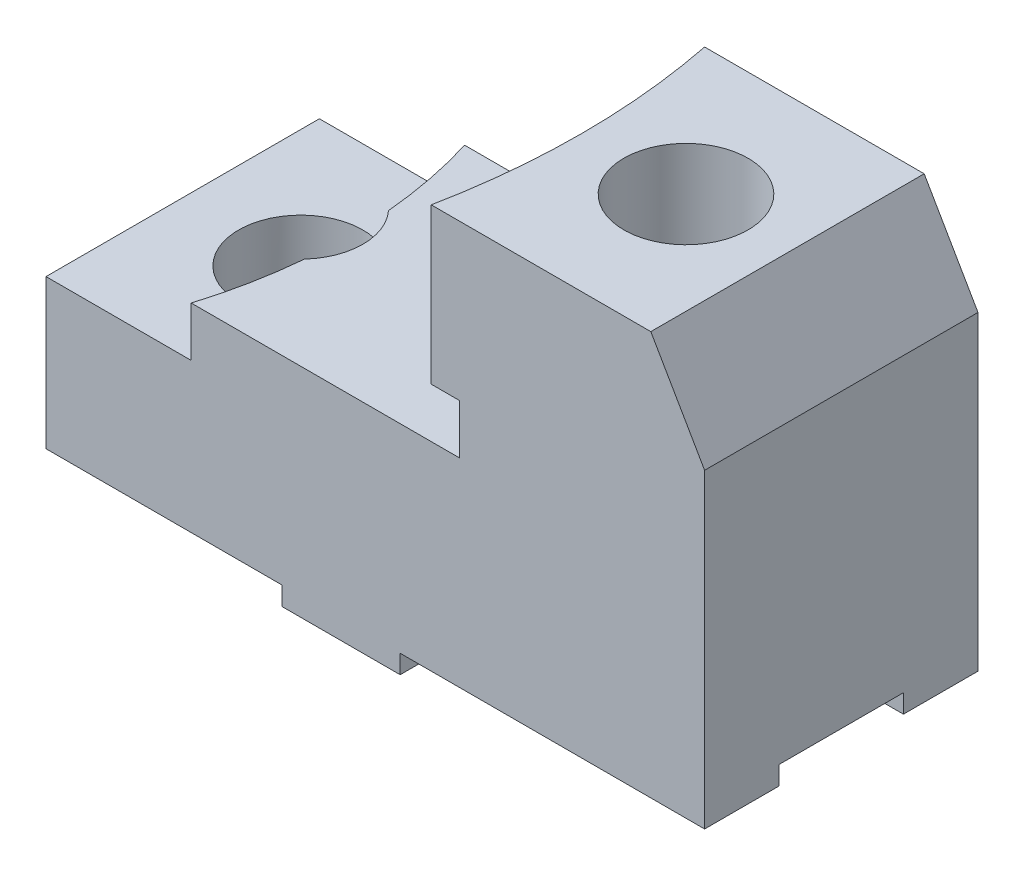
ISO-10303-21;
HEADER;
FILE_DESCRIPTION(('STEP AP214'),'2;1');
FILE_NAME('part.step','',(''),(''),'','','');
FILE_SCHEMA(('AUTOMOTIVE_DESIGN { 1 0 10303 214 1 1 1 1 }'));
ENDSEC;
DATA;
#1=APPLICATION_CONTEXT('core data for automotive mechanical design processes');
#2=APPLICATION_PROTOCOL_DEFINITION('international standard','automotive_design',2000,#1);
#3=PRODUCT_CONTEXT('',#1,'mechanical');
#4=PRODUCT('Part','Part','',(#3));
#5=PRODUCT_RELATED_PRODUCT_CATEGORY('part','',(#4));
#6=PRODUCT_DEFINITION_FORMATION('','',#4);
#7=PRODUCT_DEFINITION_CONTEXT('part definition',#1,'design');
#8=PRODUCT_DEFINITION('design','',#6,#7);
#9=PRODUCT_DEFINITION_SHAPE('','',#8);
#10=(LENGTH_UNIT() NAMED_UNIT(*) SI_UNIT(.MILLI.,.METRE.));
#11=(NAMED_UNIT(*) PLANE_ANGLE_UNIT() SI_UNIT($,.RADIAN.));
#12=(NAMED_UNIT(*) SI_UNIT($,.STERADIAN.) SOLID_ANGLE_UNIT());
#13=UNCERTAINTY_MEASURE_WITH_UNIT(LENGTH_MEASURE(1.E-05),#10,'distance_accuracy_value','');
#14=(GEOMETRIC_REPRESENTATION_CONTEXT(3) GLOBAL_UNCERTAINTY_ASSIGNED_CONTEXT((#13)) GLOBAL_UNIT_ASSIGNED_CONTEXT((#10,
#11,#12)) REPRESENTATION_CONTEXT('',''));
#15=CARTESIAN_POINT('',(0.,0.,0.));
#16=DIRECTION('',(0.,0.,1.));
#17=DIRECTION('',(1.,0.,0.));
#18=AXIS2_PLACEMENT_3D('',#15,#16,#17);
#19=CARTESIAN_POINT('',(-9.49999999999999,-12.,-44.));
#20=DIRECTION('',(0.,-1.,0.));
#21=DIRECTION('',(1.,0.,0.));
#22=AXIS2_PLACEMENT_3D('',#19,#20,#21);
#23=PLANE('',#22);
#24=DIRECTION('',(1.,0.,0.));
#25=VECTOR('',#24,1.);
#26=CARTESIAN_POINT('',(-9.49999999999999,-12.,-32.));
#27=LINE('',#26,#25);
#28=CARTESIAN_POINT('',(-47.5,-12.,-32.));
#29=VERTEX_POINT('',#28);
#30=CARTESIAN_POINT('',(-9.49999999999999,-12.,-32.));
#31=VERTEX_POINT('',#30);
#32=EDGE_CURVE('E268',#29,#31,#27,.T.);
#33=ORIENTED_EDGE('',*,*,#32,.F.);
#34=DIRECTION('',(0.,0.,1.));
#35=VECTOR('',#34,1.);
#36=CARTESIAN_POINT('',(-47.5,-12.,-44.));
#37=LINE('',#36,#35);
#38=CARTESIAN_POINT('',(-47.5,-12.,-44.));
#39=VERTEX_POINT('',#38);
#40=EDGE_CURVE('E403',#39,#29,#37,.T.);
#41=ORIENTED_EDGE('',*,*,#40,.F.);
#42=DIRECTION('',(1.,0.,0.));
#43=VECTOR('',#42,1.);
#44=CARTESIAN_POINT('',(-9.49999999999999,-12.,-44.));
#45=LINE('',#44,#43);
#46=CARTESIAN_POINT('',(-9.49999999999999,-12.,-44.));
#47=VERTEX_POINT('',#46);
#48=EDGE_CURVE('E357',#39,#47,#45,.T.);
#49=ORIENTED_EDGE('',*,*,#48,.T.);
#50=DIRECTION('',(0.,0.,1.));
#51=VECTOR('',#50,1.);
#52=CARTESIAN_POINT('',(-9.49999999999999,-12.,-44.));
#53=LINE('',#52,#51);
#54=EDGE_CURVE('E425',#47,#31,#53,.T.);
#55=ORIENTED_EDGE('',*,*,#54,.T.);
#56=EDGE_LOOP('',(#33,#41,#49,#55));
#57=FACE_BOUND('',#56,.T.);
#58=ADVANCED_FACE('F55',(#57),#23,.T.);
#59=CARTESIAN_POINT('',(58.5,-12.,-44.));
#60=DIRECTION('',(0.,-1.,0.));
#61=DIRECTION('',(0.,0.,-1.));
#62=AXIS2_PLACEMENT_3D('',#59,#60,#61);
#63=PLANE('',#62);
#64=DIRECTION('',(1.,0.,0.));
#65=VECTOR('',#64,1.);
#66=CARTESIAN_POINT('',(58.5,-12.,-32.));
#67=LINE('',#66,#65);
#68=CARTESIAN_POINT('',(9.50000000000001,-12.,-32.));
#69=VERTEX_POINT('',#68);
#70=CARTESIAN_POINT('',(58.5,-12.,-32.));
#71=VERTEX_POINT('',#70);
#72=EDGE_CURVE('E272',#69,#71,#67,.T.);
#73=ORIENTED_EDGE('',*,*,#72,.F.);
#74=DIRECTION('',(0.,0.,1.));
#75=VECTOR('',#74,1.);
#76=CARTESIAN_POINT('',(9.50000000000001,-12.,-44.));
#77=LINE('',#76,#75);
#78=CARTESIAN_POINT('',(9.50000000000001,-12.,-44.));
#79=VERTEX_POINT('',#78);
#80=EDGE_CURVE('E413',#79,#69,#77,.T.);
#81=ORIENTED_EDGE('',*,*,#80,.F.);
#82=DIRECTION('',(1.,0.,0.));
#83=VECTOR('',#82,1.);
#84=CARTESIAN_POINT('',(58.5,-12.,-44.));
#85=LINE('',#84,#83);
#86=CARTESIAN_POINT('',(58.5,-12.,-44.));
#87=VERTEX_POINT('',#86);
#88=EDGE_CURVE('E370',#79,#87,#85,.T.);
#89=ORIENTED_EDGE('',*,*,#88,.T.);
#90=DIRECTION('',(0.,0.,1.));
#91=VECTOR('',#90,1.);
#92=CARTESIAN_POINT('',(58.5,-12.,-44.));
#93=LINE('',#92,#91);
#94=EDGE_CURVE('E410',#87,#71,#93,.T.);
#95=ORIENTED_EDGE('',*,*,#94,.T.);
#96=EDGE_LOOP('',(#73,#81,#89,#95));
#97=FACE_BOUND('',#96,.T.);
#98=ADVANCED_FACE('F468',(#97),#63,.T.);
#99=CARTESIAN_POINT('',(9.50000000000001,-12.,-44.));
#100=DIRECTION('',(1.,0.,0.));
#101=DIRECTION('',(0.,0.,-1.));
#102=AXIS2_PLACEMENT_3D('',#99,#100,#101);
#103=PLANE('',#102);
#104=DIRECTION('',(0.,1.,0.));
#105=VECTOR('',#104,1.);
#106=CARTESIAN_POINT('',(9.50000000000001,-12.,-32.));
#107=LINE('',#106,#105);
#108=CARTESIAN_POINT('',(9.50000000000001,-15.,-32.));
#109=VERTEX_POINT('',#108);
#110=EDGE_CURVE('E270',#109,#69,#107,.T.);
#111=ORIENTED_EDGE('',*,*,#110,.F.);
#112=DIRECTION('',(0.,0.,1.));
#113=VECTOR('',#112,1.);
#114=CARTESIAN_POINT('',(9.50000000000001,-15.,-44.));
#115=LINE('',#114,#113);
#116=CARTESIAN_POINT('',(9.50000000000001,-15.,-44.));
#117=VERTEX_POINT('',#116);
#118=EDGE_CURVE('E417',#117,#109,#115,.T.);
#119=ORIENTED_EDGE('',*,*,#118,.F.);
#120=DIRECTION('',(0.,1.,0.));
#121=VECTOR('',#120,1.);
#122=CARTESIAN_POINT('',(9.50000000000001,-12.,-44.));
#123=LINE('',#122,#121);
#124=EDGE_CURVE('E367',#117,#79,#123,.T.);
#125=ORIENTED_EDGE('',*,*,#124,.T.);
#126=ORIENTED_EDGE('',*,*,#80,.T.);
#127=EDGE_LOOP('',(#111,#119,#125,#126));
#128=FACE_BOUND('',#127,.T.);
#129=ADVANCED_FACE('F466',(#128),#103,.T.);
#130=CARTESIAN_POINT('',(9.50000000000001,-15.,-44.));
#131=DIRECTION('',(0.,-1.,0.));
#132=DIRECTION('',(1.,0.,0.));
#133=AXIS2_PLACEMENT_3D('',#130,#131,#132);
#134=PLANE('',#133);
#135=DIRECTION('',(-1.,0.,0.));
#136=VECTOR('',#135,1.);
#137=CARTESIAN_POINT('',(58.5,-15.,-32.));
#138=LINE('',#137,#136);
#139=CARTESIAN_POINT('',(-9.49999999999999,-15.,-32.));
#140=VERTEX_POINT('',#139);
#141=EDGE_CURVE('E253',#109,#140,#138,.T.);
#142=ORIENTED_EDGE('',*,*,#141,.T.);
#143=DIRECTION('',(0.,0.,1.));
#144=VECTOR('',#143,1.);
#145=CARTESIAN_POINT('',(-9.49999999999999,-15.,-44.));
#146=LINE('',#145,#144);
#147=CARTESIAN_POINT('',(-9.49999999999999,-15.,-44.));
#148=VERTEX_POINT('',#147);
#149=EDGE_CURVE('E421',#148,#140,#146,.T.);
#150=ORIENTED_EDGE('',*,*,#149,.F.);
#151=DIRECTION('',(1.,0.,0.));
#152=VECTOR('',#151,1.);
#153=CARTESIAN_POINT('',(9.50000000000001,-15.,-44.));
#154=LINE('',#153,#152);
#155=EDGE_CURVE('E364',#148,#117,#154,.T.);
#156=ORIENTED_EDGE('',*,*,#155,.T.);
#157=ORIENTED_EDGE('',*,*,#118,.T.);
#158=EDGE_LOOP('',(#142,#150,#156,#157));
#159=FACE_BOUND('',#158,.T.);
#160=ADVANCED_FACE('F462',(#159),#134,.T.);
#161=CARTESIAN_POINT('',(-9.49999999999999,-15.,-44.));
#162=DIRECTION('',(-1.,0.,0.));
#163=DIRECTION('',(0.,0.,1.));
#164=AXIS2_PLACEMENT_3D('',#161,#162,#163);
#165=PLANE('',#164);
#166=DIRECTION('',(0.,-1.,0.));
#167=VECTOR('',#166,1.);
#168=CARTESIAN_POINT('',(-9.49999999999999,-15.,-32.));
#169=LINE('',#168,#167);
#170=EDGE_CURVE('E14',#31,#140,#169,.T.);
#171=ORIENTED_EDGE('',*,*,#170,.F.);
#172=ORIENTED_EDGE('',*,*,#54,.F.);
#173=DIRECTION('',(0.,-1.,0.));
#174=VECTOR('',#173,1.);
#175=CARTESIAN_POINT('',(-9.49999999999999,-15.,-44.));
#176=LINE('',#175,#174);
#177=EDGE_CURVE('E360',#47,#148,#176,.T.);
#178=ORIENTED_EDGE('',*,*,#177,.T.);
#179=ORIENTED_EDGE('',*,*,#149,.T.);
#180=EDGE_LOOP('',(#171,#172,#178,#179));
#181=FACE_BOUND('',#180,.T.);
#182=ADVANCED_FACE('F455',(#181),#165,.T.);
#183=CARTESIAN_POINT('',(-95.8279203103185,53.,-22.));
#184=DIRECTION('',(0.,-1.,0.));
#185=DIRECTION('',(1.,0.,0.));
#186=AXIS2_PLACEMENT_3D('',#183,#184,#185);
#187=CYLINDRICAL_SURFACE('',#186,117.);
#188=DIRECTION('',(0.,-1.,0.));
#189=VECTOR('',#188,1.);
#190=CARTESIAN_POINT('',(19.0850902672484,53.,0.));
#191=LINE('',#190,#189);
#192=CARTESIAN_POINT('',(19.0850902672484,28.,0.));
#193=VERTEX_POINT('',#192);
#194=CARTESIAN_POINT('',(19.0850902672484,20.,0.));
#195=VERTEX_POINT('',#194);
#196=EDGE_CURVE('E324',#193,#195,#191,.T.);
#197=ORIENTED_EDGE('',*,*,#196,.F.);
#198=CARTESIAN_POINT('',(-95.8279203103185,28.,-22.));
#199=DIRECTION('',(0.,1.,0.));
#200=DIRECTION('',(-1.,0.,0.));
#201=AXIS2_PLACEMENT_3D('',#198,#199,#200);
#202=CIRCLE('',#201,117.);
#203=CARTESIAN_POINT('',(19.0850902672484,28.,-44.));
#204=VERTEX_POINT('',#203);
#205=EDGE_CURVE('E300',#193,#204,#202,.T.);
#206=ORIENTED_EDGE('',*,*,#205,.T.);
#207=DIRECTION('',(0.,-1.,0.));
#208=VECTOR('',#207,1.);
#209=CARTESIAN_POINT('',(19.0850902672484,53.,-44.));
#210=LINE('',#209,#208);
#211=CARTESIAN_POINT('',(19.0850902672484,20.,-44.));
#212=VERTEX_POINT('',#211);
#213=EDGE_CURVE('E322',#204,#212,#210,.T.);
#214=ORIENTED_EDGE('',*,*,#213,.T.);
#215=CARTESIAN_POINT('',(-95.8279203103185,20.,-22.));
#216=DIRECTION('',(0.,1.,0.));
#217=DIRECTION('',(-1.,0.,0.));
#218=AXIS2_PLACEMENT_3D('',#215,#216,#217);
#219=CIRCLE('',#218,117.);
#220=EDGE_CURVE('E337',#195,#212,#219,.T.);
#221=ORIENTED_EDGE('',*,*,#220,.F.);
#222=EDGE_LOOP('',(#197,#206,#214,#221));
#223=FACE_BOUND('',#222,.T.);
#224=ADVANCED_FACE('F503',(#223),#187,.F.);
#225=CARTESIAN_POINT('',(-47.5,12.,-44.));
#226=DIRECTION('',(0.,1.,0.));
#227=DIRECTION('',(0.,0.,1.));
#228=AXIS2_PLACEMENT_3D('',#225,#226,#227);
#229=PLANE('',#228);
#230=CARTESIAN_POINT('',(-28.5,12.,-22.));
#231=DIRECTION('',(0.,1.,0.));
#232=DIRECTION('',(0.,0.,1.));
#233=AXIS2_PLACEMENT_3D('',#230,#231,#232);
#234=CIRCLE('',#233,10.);
#235=CARTESIAN_POINT('',(-21.1334339296726,12.,-28.7626699114701));
#236=VERTEX_POINT('',#235);
#237=CARTESIAN_POINT('',(-21.1334339296727,12.,-15.2373300885299));
#238=VERTEX_POINT('',#237);
#239=EDGE_CURVE('E297',#236,#238,#234,.T.);
#240=ORIENTED_EDGE('',*,*,#239,.F.);
#241=CARTESIAN_POINT('',(-95.8279203103185,12.,-22.));
#242=DIRECTION('',(0.,1.,0.));
#243=DIRECTION('',(-1.,0.,0.));
#244=AXIS2_PLACEMENT_3D('',#241,#242,#243);
#245=CIRCLE('',#244,75.);
#246=CARTESIAN_POINT('',(-24.1271532293451,12.,-44.));
#247=VERTEX_POINT('',#246);
#248=EDGE_CURVE('E331',#247,#236,#245,.F.);
#249=ORIENTED_EDGE('',*,*,#248,.F.);
#250=DIRECTION('',(-1.,0.,0.));
#251=VECTOR('',#250,1.);
#252=CARTESIAN_POINT('',(-47.5,12.,-44.));
#253=LINE('',#252,#251);
#254=CARTESIAN_POINT('',(-47.5,12.,-44.));
#255=VERTEX_POINT('',#254);
#256=EDGE_CURVE('E376',#247,#255,#253,.T.);
#257=ORIENTED_EDGE('',*,*,#256,.T.);
#258=DIRECTION('',(0.,0.,1.));
#259=VECTOR('',#258,1.);
#260=CARTESIAN_POINT('',(-47.5,12.,-44.));
#261=LINE('',#260,#259);
#262=CARTESIAN_POINT('',(-47.5,12.,0.));
#263=VERTEX_POINT('',#262);
#264=EDGE_CURVE('E407',#255,#263,#261,.T.);
#265=ORIENTED_EDGE('',*,*,#264,.T.);
#266=DIRECTION('',(-1.,0.,0.));
#267=VECTOR('',#266,1.);
#268=CARTESIAN_POINT('',(-47.5,12.,0.));
#269=LINE('',#268,#267);
#270=CARTESIAN_POINT('',(-24.1271532293451,12.,0.));
#271=VERTEX_POINT('',#270);
#272=EDGE_CURVE('E399',#271,#263,#269,.T.);
#273=ORIENTED_EDGE('',*,*,#272,.F.);
#274=EDGE_CURVE('E326',#238,#271,#245,.F.);
#275=ORIENTED_EDGE('',*,*,#274,.F.);
#276=EDGE_LOOP('',(#240,#249,#257,#265,#273,#275));
#277=FACE_BOUND('',#276,.T.);
#278=ADVANCED_FACE('F497',(#277),#229,.T.);
#279=DIRECTION('',(-1.,0.,0.));
#280=VECTOR('',#279,1.);
#281=CARTESIAN_POINT('',(-9.49999999999999,-12.,-12.));
#282=LINE('',#281,#280);
#283=CARTESIAN_POINT('',(-9.49999999999999,-12.,-12.));
#284=VERTEX_POINT('',#283);
#285=CARTESIAN_POINT('',(-47.5,-12.,-12.));
#286=VERTEX_POINT('',#285);
#287=EDGE_CURVE('E262',#284,#286,#282,.T.);
#288=ORIENTED_EDGE('',*,*,#287,.F.);
#289=CARTESIAN_POINT('',(-9.49999999999999,-12.,0.));
#290=VERTEX_POINT('',#289);
#291=EDGE_CURVE('E381',#284,#290,#53,.T.);
#292=ORIENTED_EDGE('',*,*,#291,.T.);
#293=DIRECTION('',(1.,0.,0.));
#294=VECTOR('',#293,1.);
#295=CARTESIAN_POINT('',(-9.49999999999999,-12.,0.));
#296=LINE('',#295,#294);
#297=CARTESIAN_POINT('',(-47.5,-12.,0.));
#298=VERTEX_POINT('',#297);
#299=EDGE_CURVE('E356',#298,#290,#296,.T.);
#300=ORIENTED_EDGE('',*,*,#299,.F.);
#301=EDGE_CURVE('E406',#286,#298,#37,.T.);
#302=ORIENTED_EDGE('',*,*,#301,.F.);
#303=EDGE_LOOP('',(#288,#292,#300,#302));
#304=FACE_BOUND('',#303,.T.);
#305=ADVANCED_FACE('F57',(#304),#23,.T.);
#306=CARTESIAN_POINT('',(-47.5,-12.,-44.));
#307=DIRECTION('',(-1.,0.,0.));
#308=DIRECTION('',(0.,0.,1.));
#309=AXIS2_PLACEMENT_3D('',#306,#307,#308);
#310=PLANE('',#309);
#311=DIRECTION('',(0.,-1.,0.));
#312=VECTOR('',#311,1.);
#313=CARTESIAN_POINT('',(-47.5,-9.00000000000001,-32.));
#314=LINE('',#313,#312);
#315=CARTESIAN_POINT('',(-47.5,-9.00000000000001,-32.));
#316=VERTEX_POINT('',#315);
#317=EDGE_CURVE('E245',#316,#29,#314,.T.);
#318=ORIENTED_EDGE('',*,*,#317,.F.);
#319=DIRECTION('',(0.,0.,-1.));
#320=VECTOR('',#319,1.);
#321=CARTESIAN_POINT('',(-47.5,-9.00000000000001,-12.));
#322=LINE('',#321,#320);
#323=CARTESIAN_POINT('',(-47.5,-9.00000000000001,-12.));
#324=VERTEX_POINT('',#323);
#325=EDGE_CURVE('E247',#324,#316,#322,.T.);
#326=ORIENTED_EDGE('',*,*,#325,.F.);
#327=DIRECTION('',(0.,1.,0.));
#328=VECTOR('',#327,1.);
#329=CARTESIAN_POINT('',(-47.5,-15.,-12.));
#330=LINE('',#329,#328);
#331=EDGE_CURVE('E226',#286,#324,#330,.T.);
#332=ORIENTED_EDGE('',*,*,#331,.F.);
#333=ORIENTED_EDGE('',*,*,#301,.T.);
#334=DIRECTION('',(0.,-1.,0.));
#335=VECTOR('',#334,1.);
#336=CARTESIAN_POINT('',(-47.5,-12.,0.));
#337=LINE('',#336,#335);
#338=EDGE_CURVE('E361',#263,#298,#337,.T.);
#339=ORIENTED_EDGE('',*,*,#338,.F.);
#340=ORIENTED_EDGE('',*,*,#264,.F.);
#341=DIRECTION('',(0.,-1.,0.));
#342=VECTOR('',#341,1.);
#343=CARTESIAN_POINT('',(-47.5,-12.,-44.));
#344=LINE('',#343,#342);
#345=EDGE_CURVE('E378',#255,#39,#344,.T.);
#346=ORIENTED_EDGE('',*,*,#345,.T.);
#347=ORIENTED_EDGE('',*,*,#40,.T.);
#348=EDGE_LOOP('',(#318,#326,#332,#333,#339,#340,#346,#347));
#349=FACE_BOUND('',#348,.T.);
#350=ADVANCED_FACE('F445',(#349),#310,.T.);
#351=CARTESIAN_POINT('',(58.5,12.,-44.));
#352=DIRECTION('',(1.,0.,0.));
#353=DIRECTION('',(0.,0.,-1.));
#354=AXIS2_PLACEMENT_3D('',#351,#352,#353);
#355=PLANE('',#354);
#356=DIRECTION('',(0.,-1.,0.));
#357=VECTOR('',#356,1.);
#358=CARTESIAN_POINT('',(58.5,-9.00000000000001,-32.));
#359=LINE('',#358,#357);
#360=CARTESIAN_POINT('',(58.5,-9.00000000000001,-32.));
#361=VERTEX_POINT('',#360);
#362=EDGE_CURVE('E239',#361,#71,#359,.T.);
#363=ORIENTED_EDGE('',*,*,#362,.T.);
#364=ORIENTED_EDGE('',*,*,#94,.F.);
#365=DIRECTION('',(0.,1.,0.));
#366=VECTOR('',#365,1.);
#367=CARTESIAN_POINT('',(58.5,12.,-44.));
#368=LINE('',#367,#366);
#369=CARTESIAN_POINT('',(58.5,38.,-44.));
#370=VERTEX_POINT('',#369);
#371=EDGE_CURVE('E373',#87,#370,#368,.T.);
#372=ORIENTED_EDGE('',*,*,#371,.T.);
#373=DIRECTION('',(0.,0.,1.));
#374=VECTOR('',#373,1.);
#375=CARTESIAN_POINT('',(58.5,38.,-44.));
#376=LINE('',#375,#374);
#377=CARTESIAN_POINT('',(58.5,38.,0.));
#378=VERTEX_POINT('',#377);
#379=EDGE_CURVE('E278',#370,#378,#376,.T.);
#380=ORIENTED_EDGE('',*,*,#379,.T.);
#381=DIRECTION('',(0.,1.,0.));
#382=VECTOR('',#381,1.);
#383=CARTESIAN_POINT('',(58.5,12.,0.));
#384=LINE('',#383,#382);
#385=CARTESIAN_POINT('',(58.5,-12.,0.));
#386=VERTEX_POINT('',#385);
#387=EDGE_CURVE('E396',#386,#378,#384,.T.);
#388=ORIENTED_EDGE('',*,*,#387,.F.);
#389=CARTESIAN_POINT('',(58.5,-12.,-12.));
#390=VERTEX_POINT('',#389);
#391=EDGE_CURVE('E244',#390,#386,#93,.T.);
#392=ORIENTED_EDGE('',*,*,#391,.F.);
#393=DIRECTION('',(0.,1.,0.));
#394=VECTOR('',#393,1.);
#395=CARTESIAN_POINT('',(58.5,-15.,-12.));
#396=LINE('',#395,#394);
#397=CARTESIAN_POINT('',(58.5,-9.00000000000001,-12.));
#398=VERTEX_POINT('',#397);
#399=EDGE_CURVE('E223',#390,#398,#396,.T.);
#400=ORIENTED_EDGE('',*,*,#399,.T.);
#401=DIRECTION('',(0.,0.,-1.));
#402=VECTOR('',#401,1.);
#403=CARTESIAN_POINT('',(58.5,-9.00000000000001,-12.));
#404=LINE('',#403,#402);
#405=EDGE_CURVE('E233',#398,#361,#404,.T.);
#406=ORIENTED_EDGE('',*,*,#405,.T.);
#407=EDGE_LOOP('',(#363,#364,#372,#380,#388,#392,#400,#406));
#408=FACE_BOUND('',#407,.T.);
#409=ADVANCED_FACE('F242',(#408),#355,.T.);
#410=DIRECTION('',(-1.,0.,0.));
#411=VECTOR('',#410,1.);
#412=CARTESIAN_POINT('',(58.5,-12.,-12.));
#413=LINE('',#412,#411);
#414=CARTESIAN_POINT('',(9.50000000000001,-12.,-12.));
#415=VERTEX_POINT('',#414);
#416=EDGE_CURVE('E266',#390,#415,#413,.T.);
#417=ORIENTED_EDGE('',*,*,#416,.F.);
#418=ORIENTED_EDGE('',*,*,#391,.T.);
#419=DIRECTION('',(1.,0.,0.));
#420=VECTOR('',#419,1.);
#421=CARTESIAN_POINT('',(58.5,-12.,0.));
#422=LINE('',#421,#420);
#423=CARTESIAN_POINT('',(9.50000000000001,-12.,0.));
#424=VERTEX_POINT('',#423);
#425=EDGE_CURVE('E393',#424,#386,#422,.T.);
#426=ORIENTED_EDGE('',*,*,#425,.F.);
#427=EDGE_CURVE('E416',#415,#424,#77,.T.);
#428=ORIENTED_EDGE('',*,*,#427,.F.);
#429=EDGE_LOOP('',(#417,#418,#426,#428));
#430=FACE_BOUND('',#429,.T.);
#431=ADVANCED_FACE('F476',(#430),#63,.T.);
#432=DIRECTION('',(0.,-1.,0.));
#433=VECTOR('',#432,1.);
#434=CARTESIAN_POINT('',(9.50000000000001,-12.,-12.));
#435=LINE('',#434,#433);
#436=CARTESIAN_POINT('',(9.50000000000001,-15.,-12.));
#437=VERTEX_POINT('',#436);
#438=EDGE_CURVE('E264',#415,#437,#435,.T.);
#439=ORIENTED_EDGE('',*,*,#438,.F.);
#440=ORIENTED_EDGE('',*,*,#427,.T.);
#441=DIRECTION('',(0.,1.,0.));
#442=VECTOR('',#441,1.);
#443=CARTESIAN_POINT('',(9.50000000000001,-12.,0.));
#444=LINE('',#443,#442);
#445=CARTESIAN_POINT('',(9.50000000000001,-15.,0.));
#446=VERTEX_POINT('',#445);
#447=EDGE_CURVE('E390',#446,#424,#444,.T.);
#448=ORIENTED_EDGE('',*,*,#447,.F.);
#449=EDGE_CURVE('E420',#437,#446,#115,.T.);
#450=ORIENTED_EDGE('',*,*,#449,.F.);
#451=EDGE_LOOP('',(#439,#440,#448,#450));
#452=FACE_BOUND('',#451,.T.);
#453=ADVANCED_FACE('F480',(#452),#103,.T.);
#454=DIRECTION('',(-1.,0.,0.));
#455=VECTOR('',#454,1.);
#456=CARTESIAN_POINT('',(58.5,-15.,-12.));
#457=LINE('',#456,#455);
#458=CARTESIAN_POINT('',(-9.49999999999999,-15.,-12.));
#459=VERTEX_POINT('',#458);
#460=EDGE_CURVE('E70',#437,#459,#457,.T.);
#461=ORIENTED_EDGE('',*,*,#460,.F.);
#462=ORIENTED_EDGE('',*,*,#449,.T.);
#463=DIRECTION('',(1.,0.,0.));
#464=VECTOR('',#463,1.);
#465=CARTESIAN_POINT('',(9.50000000000001,-15.,0.));
#466=LINE('',#465,#464);
#467=CARTESIAN_POINT('',(-9.49999999999999,-15.,0.));
#468=VERTEX_POINT('',#467);
#469=EDGE_CURVE('E387',#468,#446,#466,.T.);
#470=ORIENTED_EDGE('',*,*,#469,.F.);
#471=EDGE_CURVE('E424',#459,#468,#146,.T.);
#472=ORIENTED_EDGE('',*,*,#471,.F.);
#473=EDGE_LOOP('',(#461,#462,#470,#472));
#474=FACE_BOUND('',#473,.T.);
#475=ADVANCED_FACE('F482',(#474),#134,.T.);
#476=DIRECTION('',(0.,1.,0.));
#477=VECTOR('',#476,1.);
#478=CARTESIAN_POINT('',(-9.49999999999999,-15.,-12.));
#479=LINE('',#478,#477);
#480=EDGE_CURVE('E63',#459,#284,#479,.T.);
#481=ORIENTED_EDGE('',*,*,#480,.F.);
#482=ORIENTED_EDGE('',*,*,#471,.T.);
#483=DIRECTION('',(0.,-1.,0.));
#484=VECTOR('',#483,1.);
#485=CARTESIAN_POINT('',(-9.49999999999999,-15.,0.));
#486=LINE('',#485,#484);
#487=EDGE_CURVE('E384',#290,#468,#486,.T.);
#488=ORIENTED_EDGE('',*,*,#487,.F.);
#489=ORIENTED_EDGE('',*,*,#291,.F.);
#490=EDGE_LOOP('',(#481,#482,#488,#489));
#491=FACE_BOUND('',#490,.T.);
#492=ADVANCED_FACE('F437',(#491),#165,.T.);
#493=CARTESIAN_POINT('',(0.,0.,-44.));
#494=DIRECTION('',(0.,0.,-1.));
#495=DIRECTION('',(-1.,0.,0.));
#496=AXIS2_PLACEMENT_3D('',#493,#494,#495);
#497=PLANE('',#496);
#498=DIRECTION('',(0.499999999999995,-0.866025403784442,0.));
#499=VECTOR('',#498,1.);
#500=CARTESIAN_POINT('',(49.8397459621557,53.,-44.));
#501=LINE('',#500,#499);
#502=CARTESIAN_POINT('',(49.8397459621557,53.,-44.));
#503=VERTEX_POINT('',#502);
#504=EDGE_CURVE('E78',#503,#370,#501,.T.);
#505=ORIENTED_EDGE('',*,*,#504,.T.);
#506=ORIENTED_EDGE('',*,*,#371,.F.);
#507=ORIENTED_EDGE('',*,*,#88,.F.);
#508=ORIENTED_EDGE('',*,*,#124,.F.);
#509=ORIENTED_EDGE('',*,*,#155,.F.);
#510=ORIENTED_EDGE('',*,*,#177,.F.);
#511=ORIENTED_EDGE('',*,*,#48,.F.);
#512=ORIENTED_EDGE('',*,*,#345,.F.);
#513=ORIENTED_EDGE('',*,*,#256,.F.);
#514=DIRECTION('',(0.,-1.,0.));
#515=VECTOR('',#514,1.);
#516=CARTESIAN_POINT('',(-24.1271532293451,20.,-44.));
#517=LINE('',#516,#515);
#518=CARTESIAN_POINT('',(-24.1271532293451,20.,-44.));
#519=VERTEX_POINT('',#518);
#520=EDGE_CURVE('E347',#519,#247,#517,.T.);
#521=ORIENTED_EDGE('',*,*,#520,.F.);
#522=DIRECTION('',(-1.,0.,0.));
#523=VECTOR('',#522,1.);
#524=CARTESIAN_POINT('',(0.,20.,-44.));
#525=LINE('',#524,#523);
#526=EDGE_CURVE('E340',#212,#519,#525,.T.);
#527=ORIENTED_EDGE('',*,*,#526,.F.);
#528=ORIENTED_EDGE('',*,*,#213,.F.);
#529=DIRECTION('',(1.,0.,0.));
#530=VECTOR('',#529,1.);
#531=CARTESIAN_POINT('',(0.,28.,-44.));
#532=LINE('',#531,#530);
#533=CARTESIAN_POINT('',(14.5,28.,-44.));
#534=VERTEX_POINT('',#533);
#535=EDGE_CURVE('E302',#534,#204,#532,.T.);
#536=ORIENTED_EDGE('',*,*,#535,.F.);
#537=DIRECTION('',(0.,1.,0.));
#538=VECTOR('',#537,1.);
#539=CARTESIAN_POINT('',(14.5,28.,-44.));
#540=LINE('',#539,#538);
#541=CARTESIAN_POINT('',(14.5,53.,-44.));
#542=VERTEX_POINT('',#541);
#543=EDGE_CURVE('E309',#534,#542,#540,.T.);
#544=ORIENTED_EDGE('',*,*,#543,.T.);
#545=DIRECTION('',(-1.,0.,0.));
#546=VECTOR('',#545,1.);
#547=CARTESIAN_POINT('',(0.,53.,-44.));
#548=LINE('',#547,#546);
#549=EDGE_CURVE('E320',#503,#542,#548,.T.);
#550=ORIENTED_EDGE('',*,*,#549,.F.);
#551=EDGE_LOOP('',(#505,#506,#507,#508,#509,#510,#511,#512,#513,#521,#527,#528,#536,#544,#550));
#552=FACE_BOUND('',#551,.T.);
#553=ADVANCED_FACE('F458',(#552),#497,.T.);
#554=CARTESIAN_POINT('',(0.,0.,0.));
#555=DIRECTION('',(0.,0.,-1.));
#556=DIRECTION('',(-1.,0.,0.));
#557=AXIS2_PLACEMENT_3D('',#554,#555,#556);
#558=PLANE('',#557);
#559=ORIENTED_EDGE('',*,*,#387,.T.);
#560=DIRECTION('',(0.499999999999995,-0.866025403784442,0.));
#561=VECTOR('',#560,1.);
#562=CARTESIAN_POINT('',(49.8397459621557,53.,0.));
#563=LINE('',#562,#561);
#564=CARTESIAN_POINT('',(49.8397459621557,53.,0.));
#565=VERTEX_POINT('',#564);
#566=EDGE_CURVE('E274',#565,#378,#563,.T.);
#567=ORIENTED_EDGE('',*,*,#566,.F.);
#568=DIRECTION('',(1.,0.,0.));
#569=VECTOR('',#568,1.);
#570=CARTESIAN_POINT('',(0.,53.,0.));
#571=LINE('',#570,#569);
#572=CARTESIAN_POINT('',(14.5,53.,0.));
#573=VERTEX_POINT('',#572);
#574=EDGE_CURVE('E315',#573,#565,#571,.T.);
#575=ORIENTED_EDGE('',*,*,#574,.F.);
#576=DIRECTION('',(0.,1.,0.));
#577=VECTOR('',#576,1.);
#578=CARTESIAN_POINT('',(14.5,28.,0.));
#579=LINE('',#578,#577);
#580=CARTESIAN_POINT('',(14.5,28.,0.));
#581=VERTEX_POINT('',#580);
#582=EDGE_CURVE('E312',#581,#573,#579,.T.);
#583=ORIENTED_EDGE('',*,*,#582,.F.);
#584=DIRECTION('',(-1.,0.,0.));
#585=VECTOR('',#584,1.);
#586=CARTESIAN_POINT('',(0.,28.,0.));
#587=LINE('',#586,#585);
#588=EDGE_CURVE('E307',#193,#581,#587,.T.);
#589=ORIENTED_EDGE('',*,*,#588,.F.);
#590=ORIENTED_EDGE('',*,*,#196,.T.);
#591=DIRECTION('',(1.,0.,0.));
#592=VECTOR('',#591,1.);
#593=CARTESIAN_POINT('',(0.,20.,0.));
#594=LINE('',#593,#592);
#595=CARTESIAN_POINT('',(-24.1271532293451,20.,0.));
#596=VERTEX_POINT('',#595);
#597=EDGE_CURVE('E333',#596,#195,#594,.T.);
#598=ORIENTED_EDGE('',*,*,#597,.F.);
#599=DIRECTION('',(0.,-1.,0.));
#600=VECTOR('',#599,1.);
#601=CARTESIAN_POINT('',(-24.1271532293451,20.,0.));
#602=LINE('',#601,#600);
#603=EDGE_CURVE('E350',#596,#271,#602,.T.);
#604=ORIENTED_EDGE('',*,*,#603,.T.);
#605=ORIENTED_EDGE('',*,*,#272,.T.);
#606=ORIENTED_EDGE('',*,*,#338,.T.);
#607=ORIENTED_EDGE('',*,*,#299,.T.);
#608=ORIENTED_EDGE('',*,*,#487,.T.);
#609=ORIENTED_EDGE('',*,*,#469,.T.);
#610=ORIENTED_EDGE('',*,*,#447,.T.);
#611=ORIENTED_EDGE('',*,*,#425,.T.);
#612=EDGE_LOOP('',(#559,#567,#575,#583,#589,#590,#598,#604,#605,#606,#607,#608,#609,#610,#611));
#613=FACE_BOUND('',#612,.T.);
#614=ADVANCED_FACE('F440',(#613),#558,.F.);
#615=CARTESIAN_POINT('',(-28.5,20.,-22.));
#616=DIRECTION('',(0.,-1.,0.));
#617=DIRECTION('',(1.,0.,0.));
#618=AXIS2_PLACEMENT_3D('',#615,#616,#617);
#619=CYLINDRICAL_SURFACE('',#618,10.);
#620=DIRECTION('',(0.,-1.,0.));
#621=VECTOR('',#620,1.);
#622=CARTESIAN_POINT('',(-21.1334339296726,20.,-28.7626699114701));
#623=LINE('',#622,#621);
#624=CARTESIAN_POINT('',(-21.1334339296726,20.,-28.7626699114701));
#625=VERTEX_POINT('',#624);
#626=EDGE_CURVE('E344',#625,#236,#623,.T.);
#627=ORIENTED_EDGE('',*,*,#626,.T.);
#628=ORIENTED_EDGE('',*,*,#239,.T.);
#629=DIRECTION('',(0.,-1.,0.));
#630=VECTOR('',#629,1.);
#631=CARTESIAN_POINT('',(-21.1334339296726,20.,-15.2373300885299));
#632=LINE('',#631,#630);
#633=CARTESIAN_POINT('',(-21.1334339296726,20.,-15.2373300885299));
#634=VERTEX_POINT('',#633);
#635=EDGE_CURVE('E353',#634,#238,#632,.T.);
#636=ORIENTED_EDGE('',*,*,#635,.F.);
#637=CARTESIAN_POINT('',(-28.5,20.,-22.));
#638=DIRECTION('',(0.,1.,0.));
#639=DIRECTION('',(-1.,0.,0.));
#640=AXIS2_PLACEMENT_3D('',#637,#638,#639);
#641=CIRCLE('',#640,10.);
#642=EDGE_CURVE('E327',#634,#625,#641,.T.);
#643=ORIENTED_EDGE('',*,*,#642,.T.);
#644=EDGE_LOOP('',(#627,#628,#636,#643));
#645=FACE_BOUND('',#644,.T.);
#646=CARTESIAN_POINT('',(-28.5,-2.,-22.));
#647=DIRECTION('',(0.,1.,0.));
#648=DIRECTION('',(-1.,0.,0.));
#649=AXIS2_PLACEMENT_3D('',#646,#647,#648);
#650=CIRCLE('',#649,10.);
#651=CARTESIAN_POINT('',(-38.5,-2.,-22.));
#652=VERTEX_POINT('',#651);
#653=EDGE_CURVE('E294',#652,#652,#650,.T.);
#654=ORIENTED_EDGE('',*,*,#653,.F.);
#655=EDGE_LOOP('',(#654));
#656=FACE_BOUND('',#655,.T.);
#657=ADVANCED_FACE('F626',(#645,#656),#619,.F.);
#658=CARTESIAN_POINT('',(-95.8279203103185,20.,-22.));
#659=DIRECTION('',(0.,-1.,0.));
#660=DIRECTION('',(1.,0.,0.));
#661=AXIS2_PLACEMENT_3D('',#658,#659,#660);
#662=CYLINDRICAL_SURFACE('',#661,75.);
#663=ORIENTED_EDGE('',*,*,#274,.T.);
#664=ORIENTED_EDGE('',*,*,#603,.F.);
#665=CARTESIAN_POINT('',(-95.8279203103185,20.,-22.));
#666=DIRECTION('',(0.,1.,0.));
#667=DIRECTION('',(-1.,0.,0.));
#668=AXIS2_PLACEMENT_3D('',#665,#666,#667);
#669=CIRCLE('',#668,75.);
#670=EDGE_CURVE('E330',#634,#596,#669,.F.);
#671=ORIENTED_EDGE('',*,*,#670,.F.);
#672=ORIENTED_EDGE('',*,*,#635,.T.);
#673=EDGE_LOOP('',(#663,#664,#671,#672));
#674=FACE_BOUND('',#673,.T.);
#675=ADVANCED_FACE('F624',(#674),#662,.F.);
#676=ORIENTED_EDGE('',*,*,#248,.T.);
#677=ORIENTED_EDGE('',*,*,#626,.F.);
#678=EDGE_CURVE('E334',#519,#625,#669,.F.);
#679=ORIENTED_EDGE('',*,*,#678,.F.);
#680=ORIENTED_EDGE('',*,*,#520,.T.);
#681=EDGE_LOOP('',(#676,#677,#679,#680));
#682=FACE_BOUND('',#681,.T.);
#683=ADVANCED_FACE('F620',(#682),#662,.F.);
#684=CARTESIAN_POINT('',(0.,20.,0.));
#685=DIRECTION('',(0.,1.,0.));
#686=DIRECTION('',(-1.,0.,0.));
#687=AXIS2_PLACEMENT_3D('',#684,#685,#686);
#688=PLANE('',#687);
#689=ORIENTED_EDGE('',*,*,#642,.F.);
#690=ORIENTED_EDGE('',*,*,#670,.T.);
#691=ORIENTED_EDGE('',*,*,#597,.T.);
#692=ORIENTED_EDGE('',*,*,#220,.T.);
#693=ORIENTED_EDGE('',*,*,#526,.T.);
#694=ORIENTED_EDGE('',*,*,#678,.T.);
#695=EDGE_LOOP('',(#689,#690,#691,#692,#693,#694));
#696=FACE_BOUND('',#695,.T.);
#697=ADVANCED_FACE('F615',(#696),#688,.T.);
#698=CARTESIAN_POINT('',(0.,53.,0.));
#699=DIRECTION('',(0.,1.,0.));
#700=DIRECTION('',(-1.,0.,0.));
#701=AXIS2_PLACEMENT_3D('',#698,#699,#700);
#702=PLANE('',#701);
#703=DIRECTION('',(0.,0.,1.));
#704=VECTOR('',#703,1.);
#705=CARTESIAN_POINT('',(49.8397459621557,53.,-44.));
#706=LINE('',#705,#704);
#707=EDGE_CURVE('E276',#503,#565,#706,.T.);
#708=ORIENTED_EDGE('',*,*,#707,.F.);
#709=ORIENTED_EDGE('',*,*,#549,.T.);
#710=CARTESIAN_POINT('',(-95.8279203103185,53.,-22.));
#711=DIRECTION('',(0.,1.,0.));
#712=DIRECTION('',(-1.,0.,0.));
#713=AXIS2_PLACEMENT_3D('',#710,#711,#712);
#714=CIRCLE('',#713,112.5);
#715=EDGE_CURVE('E299',#573,#542,#714,.T.);
#716=ORIENTED_EDGE('',*,*,#715,.F.);
#717=ORIENTED_EDGE('',*,*,#574,.T.);
#718=EDGE_LOOP('',(#708,#709,#716,#717));
#719=FACE_BOUND('',#718,.T.);
#720=CARTESIAN_POINT('',(33.5,53.,-22.));
#721=DIRECTION('',(0.,1.,0.));
#722=DIRECTION('',(-1.,0.,0.));
#723=AXIS2_PLACEMENT_3D('',#720,#721,#722);
#724=CIRCLE('',#723,10.);
#725=CARTESIAN_POINT('',(23.5,53.,-22.));
#726=VERTEX_POINT('',#725);
#727=EDGE_CURVE('E285',#726,#726,#724,.T.);
#728=ORIENTED_EDGE('',*,*,#727,.F.);
#729=EDGE_LOOP('',(#728));
#730=FACE_BOUND('',#729,.T.);
#731=ADVANCED_FACE('F612',(#719,#730),#702,.T.);
#732=CARTESIAN_POINT('',(-95.8279203103185,28.,-22.));
#733=DIRECTION('',(0.,1.,0.));
#734=DIRECTION('',(-1.,0.,0.));
#735=AXIS2_PLACEMENT_3D('',#732,#733,#734);
#736=CYLINDRICAL_SURFACE('',#735,112.5);
#737=ORIENTED_EDGE('',*,*,#715,.T.);
#738=ORIENTED_EDGE('',*,*,#543,.F.);
#739=CARTESIAN_POINT('',(-95.8279203103185,28.,-22.));
#740=DIRECTION('',(0.,1.,0.));
#741=DIRECTION('',(-1.,0.,0.));
#742=AXIS2_PLACEMENT_3D('',#739,#740,#741);
#743=CIRCLE('',#742,112.5);
#744=EDGE_CURVE('E305',#581,#534,#743,.T.);
#745=ORIENTED_EDGE('',*,*,#744,.F.);
#746=ORIENTED_EDGE('',*,*,#582,.T.);
#747=EDGE_LOOP('',(#737,#738,#745,#746));
#748=FACE_BOUND('',#747,.T.);
#749=ADVANCED_FACE('F608',(#748),#736,.F.);
#750=CARTESIAN_POINT('',(-95.8279203103185,28.,-22.));
#751=DIRECTION('',(0.,1.,0.));
#752=DIRECTION('',(-1.,0.,0.));
#753=AXIS2_PLACEMENT_3D('',#750,#751,#752);
#754=PLANE('',#753);
#755=ORIENTED_EDGE('',*,*,#205,.F.);
#756=ORIENTED_EDGE('',*,*,#588,.T.);
#757=ORIENTED_EDGE('',*,*,#744,.T.);
#758=ORIENTED_EDGE('',*,*,#535,.T.);
#759=EDGE_LOOP('',(#755,#756,#757,#758));
#760=FACE_BOUND('',#759,.T.);
#761=ADVANCED_FACE('F604',(#760),#754,.F.);
#762=CARTESIAN_POINT('',(-28.5,-2.,-22.));
#763=DIRECTION('',(0.,1.,0.));
#764=DIRECTION('',(-1.,0.,0.));
#765=AXIS2_PLACEMENT_3D('',#762,#763,#764);
#766=PLANE('',#765);
#767=CARTESIAN_POINT('',(-28.5,-2.,-22.));
#768=DIRECTION('',(0.,1.,0.));
#769=DIRECTION('',(-1.,0.,0.));
#770=AXIS2_PLACEMENT_3D('',#767,#768,#769);
#771=CIRCLE('',#770,6.50000000000001);
#772=CARTESIAN_POINT('',(-35.,-2.,-22.));
#773=VERTEX_POINT('',#772);
#774=EDGE_CURVE('E289',#773,#773,#771,.T.);
#775=ORIENTED_EDGE('',*,*,#774,.F.);
#776=EDGE_LOOP('',(#775));
#777=FACE_BOUND('',#776,.T.);
#778=ORIENTED_EDGE('',*,*,#653,.T.);
#779=EDGE_LOOP('',(#778));
#780=FACE_BOUND('',#779,.T.);
#781=ADVANCED_FACE('F546',(#777,#780),#766,.T.);
#782=CARTESIAN_POINT('',(-28.5,-15.,-22.));
#783=DIRECTION('',(0.,1.,0.));
#784=DIRECTION('',(-1.,0.,0.));
#785=AXIS2_PLACEMENT_3D('',#782,#783,#784);
#786=CYLINDRICAL_SURFACE('',#785,6.50000000000001);
#787=CARTESIAN_POINT('',(-28.5,-9.00000000000001,-22.));
#788=DIRECTION('',(0.,1.,0.));
#789=DIRECTION('',(0.,0.,1.));
#790=AXIS2_PLACEMENT_3D('',#787,#788,#789);
#791=CIRCLE('',#790,6.50000000000001);
#792=CARTESIAN_POINT('',(-28.5,-9.00000000000001,-15.5));
#793=VERTEX_POINT('',#792);
#794=EDGE_CURVE('E259',#793,#793,#791,.F.);
#795=ORIENTED_EDGE('',*,*,#794,.T.);
#796=EDGE_LOOP('',(#795));
#797=FACE_BOUND('',#796,.T.);
#798=ORIENTED_EDGE('',*,*,#774,.T.);
#799=EDGE_LOOP('',(#798));
#800=FACE_BOUND('',#799,.T.);
#801=ADVANCED_FACE('F540',(#797,#800),#786,.F.);
#802=CARTESIAN_POINT('',(33.5,31.,-22.));
#803=DIRECTION('',(0.,1.,0.));
#804=DIRECTION('',(-1.,0.,0.));
#805=AXIS2_PLACEMENT_3D('',#802,#803,#804);
#806=CYLINDRICAL_SURFACE('',#805,10.);
#807=CARTESIAN_POINT('',(33.5,31.,-22.));
#808=DIRECTION('',(0.,1.,0.));
#809=DIRECTION('',(-1.,0.,0.));
#810=AXIS2_PLACEMENT_3D('',#807,#808,#809);
#811=CIRCLE('',#810,10.);
#812=CARTESIAN_POINT('',(23.5,31.,-22.));
#813=VERTEX_POINT('',#812);
#814=EDGE_CURVE('E286',#813,#813,#811,.T.);
#815=ORIENTED_EDGE('',*,*,#814,.F.);
#816=EDGE_LOOP('',(#815));
#817=FACE_BOUND('',#816,.T.);
#818=ORIENTED_EDGE('',*,*,#727,.T.);
#819=EDGE_LOOP('',(#818));
#820=FACE_BOUND('',#819,.T.);
#821=ADVANCED_FACE('F545',(#817,#820),#806,.F.);
#822=CARTESIAN_POINT('',(33.5,31.,-22.));
#823=DIRECTION('',(0.,1.,0.));
#824=DIRECTION('',(-1.,0.,0.));
#825=AXIS2_PLACEMENT_3D('',#822,#823,#824);
#826=PLANE('',#825);
#827=CARTESIAN_POINT('',(33.5,31.,-22.));
#828=DIRECTION('',(0.,1.,0.));
#829=DIRECTION('',(-1.,0.,0.));
#830=AXIS2_PLACEMENT_3D('',#827,#828,#829);
#831=CIRCLE('',#830,6.5);
#832=CARTESIAN_POINT('',(27.,31.,-22.));
#833=VERTEX_POINT('',#832);
#834=EDGE_CURVE('E281',#833,#833,#831,.T.);
#835=ORIENTED_EDGE('',*,*,#834,.F.);
#836=EDGE_LOOP('',(#835));
#837=FACE_BOUND('',#836,.T.);
#838=ORIENTED_EDGE('',*,*,#814,.T.);
#839=EDGE_LOOP('',(#838));
#840=FACE_BOUND('',#839,.T.);
#841=ADVANCED_FACE('F562',(#837,#840),#826,.T.);
#842=CARTESIAN_POINT('',(33.5,-15.,-22.));
#843=DIRECTION('',(0.,1.,0.));
#844=DIRECTION('',(-1.,0.,0.));
#845=AXIS2_PLACEMENT_3D('',#842,#843,#844);
#846=CYLINDRICAL_SURFACE('',#845,6.5);
#847=CARTESIAN_POINT('',(33.5,-9.00000000000001,-22.));
#848=DIRECTION('',(0.,1.,0.));
#849=DIRECTION('',(0.,0.,1.));
#850=AXIS2_PLACEMENT_3D('',#847,#848,#849);
#851=CIRCLE('',#850,6.5);
#852=CARTESIAN_POINT('',(33.5,-9.00000000000001,-15.5));
#853=VERTEX_POINT('',#852);
#854=EDGE_CURVE('E256',#853,#853,#851,.F.);
#855=ORIENTED_EDGE('',*,*,#854,.T.);
#856=EDGE_LOOP('',(#855));
#857=FACE_BOUND('',#856,.T.);
#858=ORIENTED_EDGE('',*,*,#834,.T.);
#859=EDGE_LOOP('',(#858));
#860=FACE_BOUND('',#859,.T.);
#861=ADVANCED_FACE('F556',(#857,#860),#846,.F.);
#862=CARTESIAN_POINT('',(49.8397459621557,53.,-44.));
#863=DIRECTION('',(-0.866025403784442,-0.499999999999995,0.));
#864=DIRECTION('',(0.499999999999995,-0.866025403784442,0.));
#865=AXIS2_PLACEMENT_3D('',#862,#863,#864);
#866=PLANE('',#865);
#867=ORIENTED_EDGE('',*,*,#566,.T.);
#868=ORIENTED_EDGE('',*,*,#379,.F.);
#869=ORIENTED_EDGE('',*,*,#504,.F.);
#870=ORIENTED_EDGE('',*,*,#707,.T.);
#871=EDGE_LOOP('',(#867,#868,#869,#870));
#872=FACE_BOUND('',#871,.T.);
#873=ADVANCED_FACE('F561',(#872),#866,.F.);
#874=CARTESIAN_POINT('',(58.5,-9.00000000000001,-12.));
#875=DIRECTION('',(0.,1.,0.));
#876=DIRECTION('',(0.,0.,1.));
#877=AXIS2_PLACEMENT_3D('',#874,#875,#876);
#878=PLANE('',#877);
#879=ORIENTED_EDGE('',*,*,#854,.F.);
#880=EDGE_LOOP('',(#879));
#881=FACE_BOUND('',#880,.T.);
#882=ORIENTED_EDGE('',*,*,#325,.T.);
#883=DIRECTION('',(-1.,0.,0.));
#884=VECTOR('',#883,1.);
#885=CARTESIAN_POINT('',(58.5,-9.00000000000001,-32.));
#886=LINE('',#885,#884);
#887=EDGE_CURVE('E230',#361,#316,#886,.T.);
#888=ORIENTED_EDGE('',*,*,#887,.F.);
#889=ORIENTED_EDGE('',*,*,#405,.F.);
#890=DIRECTION('',(-1.,0.,0.));
#891=VECTOR('',#890,1.);
#892=CARTESIAN_POINT('',(58.5,-9.00000000000001,-12.));
#893=LINE('',#892,#891);
#894=EDGE_CURVE('E219',#398,#324,#893,.T.);
#895=ORIENTED_EDGE('',*,*,#894,.T.);
#896=EDGE_LOOP('',(#882,#888,#889,#895));
#897=FACE_BOUND('',#896,.T.);
#898=ORIENTED_EDGE('',*,*,#794,.F.);
#899=EDGE_LOOP('',(#898));
#900=FACE_BOUND('',#899,.T.);
#901=ADVANCED_FACE('F234',(#881,#897,#900),#878,.F.);
#902=CARTESIAN_POINT('',(58.5,-9.00000000000001,-32.));
#903=DIRECTION('',(0.,0.,-1.));
#904=DIRECTION('',(-1.,0.,0.));
#905=AXIS2_PLACEMENT_3D('',#902,#903,#904);
#906=PLANE('',#905);
#907=ORIENTED_EDGE('',*,*,#72,.T.);
#908=ORIENTED_EDGE('',*,*,#362,.F.);
#909=ORIENTED_EDGE('',*,*,#887,.T.);
#910=ORIENTED_EDGE('',*,*,#317,.T.);
#911=ORIENTED_EDGE('',*,*,#32,.T.);
#912=ORIENTED_EDGE('',*,*,#170,.T.);
#913=ORIENTED_EDGE('',*,*,#141,.F.);
#914=ORIENTED_EDGE('',*,*,#110,.T.);
#915=EDGE_LOOP('',(#907,#908,#909,#910,#911,#912,#913,#914));
#916=FACE_BOUND('',#915,.T.);
#917=ADVANCED_FACE('F449',(#916),#906,.F.);
#918=CARTESIAN_POINT('',(58.5,-15.,-12.));
#919=DIRECTION('',(0.,0.,1.));
#920=DIRECTION('',(1.,0.,0.));
#921=AXIS2_PLACEMENT_3D('',#918,#919,#920);
#922=PLANE('',#921);
#923=ORIENTED_EDGE('',*,*,#416,.T.);
#924=ORIENTED_EDGE('',*,*,#438,.T.);
#925=ORIENTED_EDGE('',*,*,#460,.T.);
#926=ORIENTED_EDGE('',*,*,#480,.T.);
#927=ORIENTED_EDGE('',*,*,#287,.T.);
#928=ORIENTED_EDGE('',*,*,#331,.T.);
#929=ORIENTED_EDGE('',*,*,#894,.F.);
#930=ORIENTED_EDGE('',*,*,#399,.F.);
#931=EDGE_LOOP('',(#923,#924,#925,#926,#927,#928,#929,#930));
#932=FACE_BOUND('',#931,.T.);
#933=ADVANCED_FACE('F221',(#932),#922,.F.);
#934=CLOSED_SHELL('',(#58,#98,#129,#160,#182,#224,#278,#305,#350,#409,#431,#453,#475,#492,#553,
#614,#657,#675,#683,#697,#731,#749,#761,#781,#801,#821,#841,#861,#873,#901,#917,#933));
#935=MANIFOLD_SOLID_BREP('B2',#934);
#936=ADVANCED_BREP_SHAPE_REPRESENTATION('',(#18,#935),#14);
#937=SHAPE_DEFINITION_REPRESENTATION(#9,#936);
ENDSEC;
END-ISO-10303-21;
